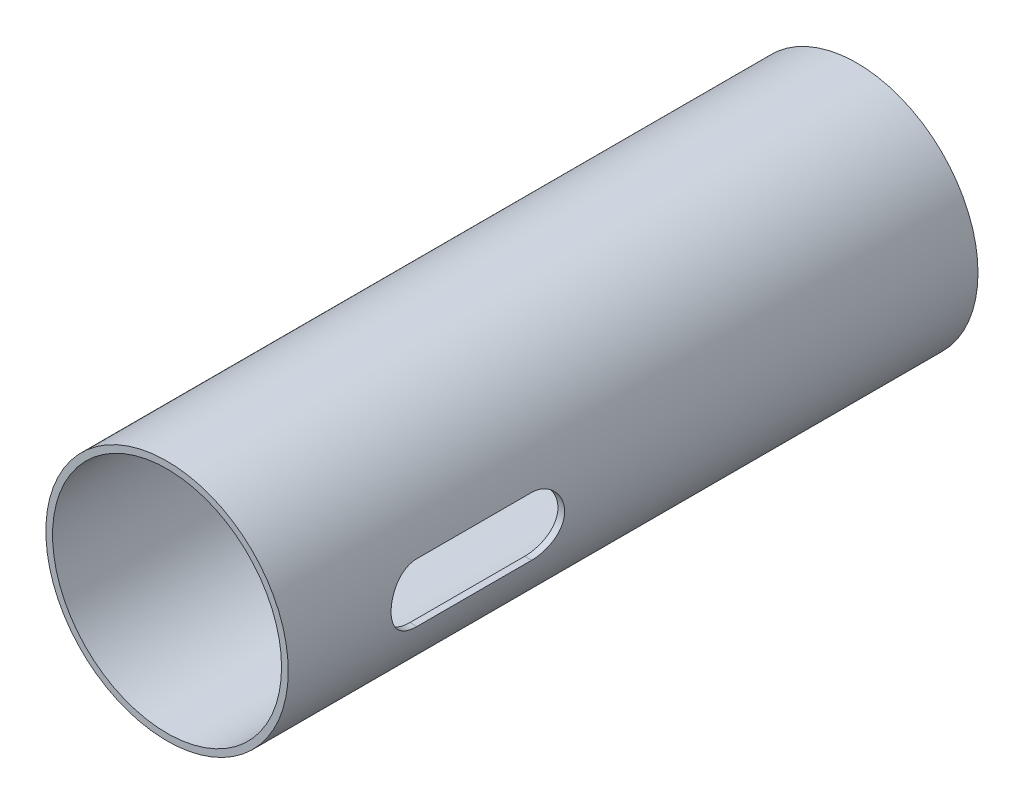
ISO-10303-21;
HEADER;
FILE_DESCRIPTION(('STEP AP214'),'2;1');
FILE_NAME('part.step','',(''),(''),'','','');
FILE_SCHEMA(('AUTOMOTIVE_DESIGN { 1 0 10303 214 1 1 1 1 }'));
ENDSEC;
DATA;
#1=APPLICATION_CONTEXT('core data for automotive mechanical design processes');
#2=APPLICATION_PROTOCOL_DEFINITION('international standard','automotive_design',2000,#1);
#3=PRODUCT_CONTEXT('',#1,'mechanical');
#4=PRODUCT('Part','Part','',(#3));
#5=PRODUCT_RELATED_PRODUCT_CATEGORY('part','',(#4));
#6=PRODUCT_DEFINITION_FORMATION('','',#4);
#7=PRODUCT_DEFINITION_CONTEXT('part definition',#1,'design');
#8=PRODUCT_DEFINITION('design','',#6,#7);
#9=PRODUCT_DEFINITION_SHAPE('','',#8);
#10=(LENGTH_UNIT() NAMED_UNIT(*) SI_UNIT(.MILLI.,.METRE.));
#11=(NAMED_UNIT(*) PLANE_ANGLE_UNIT() SI_UNIT($,.RADIAN.));
#12=(NAMED_UNIT(*) SI_UNIT($,.STERADIAN.) SOLID_ANGLE_UNIT());
#13=UNCERTAINTY_MEASURE_WITH_UNIT(LENGTH_MEASURE(1.E-05),#10,'distance_accuracy_value','');
#14=(GEOMETRIC_REPRESENTATION_CONTEXT(3) GLOBAL_UNCERTAINTY_ASSIGNED_CONTEXT((#13)) GLOBAL_UNIT_ASSIGNED_CONTEXT((#10,
#11,#12)) REPRESENTATION_CONTEXT('',''));
#15=CARTESIAN_POINT('',(0.,0.,0.));
#16=DIRECTION('',(0.,0.,1.));
#17=DIRECTION('',(1.,0.,0.));
#18=AXIS2_PLACEMENT_3D('',#15,#16,#17);
#19=CARTESIAN_POINT('',(-89.6750213814962,9.53355709039162,71.882));
#20=DIRECTION('',(0.,0.,-1.));
#21=DIRECTION('',(-1.,0.,0.));
#22=AXIS2_PLACEMENT_3D('',#19,#20,#21);
#23=CYLINDRICAL_SURFACE('',#22,12.630912);
#24=CARTESIAN_POINT('',(-89.6750213814962,9.53355709039162,0.));
#25=DIRECTION('',(0.,0.,1.));
#26=DIRECTION('',(1.,0.,0.));
#27=AXIS2_PLACEMENT_3D('',#24,#25,#26);
#28=CIRCLE('',#27,12.630912);
#29=CARTESIAN_POINT('',(-77.0441093814962,9.53355709039162,0.));
#30=VERTEX_POINT('',#29);
#31=EDGE_CURVE('E164',#30,#30,#28,.T.);
#32=ORIENTED_EDGE('',*,*,#31,.T.);
#33=EDGE_LOOP('',(#32));
#34=FACE_BOUND('',#33,.T.);
#35=CARTESIAN_POINT('',(-89.6750213814962,9.53355709039162,71.882));
#36=DIRECTION('',(0.,0.,1.));
#37=DIRECTION('',(1.,0.,0.));
#38=AXIS2_PLACEMENT_3D('',#35,#36,#37);
#39=CIRCLE('',#38,12.630912);
#40=CARTESIAN_POINT('',(-77.0441093814962,9.53355709039162,71.882));
#41=VERTEX_POINT('',#40);
#42=EDGE_CURVE('E167',#41,#41,#39,.T.);
#43=ORIENTED_EDGE('',*,*,#42,.F.);
#44=EDGE_LOOP('',(#43));
#45=FACE_BOUND('',#44,.T.);
#46=CARTESIAN_POINT('',(-77.4205506274512,12.5942570903916,58.1025));
#47=CARTESIAN_POINT('',(-77.4205597551722,12.5942668022662,58.1872319621296));
#48=CARTESIAN_POINT('',(-77.4196720286538,12.5907386708303,58.2719582289308));
#49=CARTESIAN_POINT('',(-77.4161705456482,12.5766821357091,58.4407789440411));
#50=CARTESIAN_POINT('',(-77.4135570664939,12.5661548568039,58.5248734916734));
#51=CARTESIAN_POINT('',(-77.4066782544381,12.5382019648172,58.691679412553));
#52=CARTESIAN_POINT('',(-77.4024160680688,12.520789490627,58.7743931093385));
#53=CARTESIAN_POINT('',(-77.3923741798188,12.479226655496,58.9379927834944));
#54=CARTESIAN_POINT('',(-77.3865944595793,12.4550762130413,59.0188787387404));
#55=CARTESIAN_POINT('',(-77.3672198042348,12.3727786836014,59.257940088386));
#56=CARTESIAN_POINT('',(-77.3515822224708,12.3047580788924,59.412680522662));
#57=CARTESIAN_POINT('',(-77.3166370458355,12.1444877207903,59.7085151537322));
#58=CARTESIAN_POINT('',(-77.2973285678804,12.052232135301,59.8496060545977));
#59=CARTESIAN_POINT('',(-77.2567726141075,11.8440678696077,60.1171104595098));
#60=CARTESIAN_POINT('',(-77.2354958869418,11.7277533763998,60.2432043348171));
#61=CARTESIAN_POINT('',(-77.1936537642062,11.4756439557968,60.4743004746053));
#62=CARTESIAN_POINT('',(-77.1730884820644,11.3398459396824,60.579299388559));
#63=CARTESIAN_POINT('',(-77.1346633564195,11.0504323594004,60.766529623486));
#64=CARTESIAN_POINT('',(-77.1168423106015,10.896607449675,60.8484460292532));
#65=CARTESIAN_POINT('',(-77.0862495832728,10.5768761578171,60.9851349772085));
#66=CARTESIAN_POINT('',(-77.0734769499666,10.4109720600089,61.0399126364564));
#67=CARTESIAN_POINT('',(-77.0546269352904,10.0751424417077,61.119748320122));
#68=CARTESIAN_POINT('',(-77.0484265190277,9.90535394557074,61.1453531834799));
#69=CARTESIAN_POINT('',(-77.0429913733059,9.56378194408475,61.1678312036752));
#70=CARTESIAN_POINT('',(-77.0437558295126,9.39199867431064,61.164707719436));
#71=CARTESIAN_POINT('',(-77.0520723494062,9.05510806545909,61.1302135543752));
#72=CARTESIAN_POINT('',(-77.0594824694649,8.88993621771923,61.0994335586551));
#73=CARTESIAN_POINT('',(-77.0800932654017,8.56717670995179,61.0114477409843));
#74=CARTESIAN_POINT('',(-77.0932941882632,8.40958937372928,60.9542407918926));
#75=CARTESIAN_POINT('',(-77.1242235392697,8.104891012333,60.8145349781668));
#76=CARTESIAN_POINT('',(-77.1419900634578,7.95788215532242,60.7318220662535));
#77=CARTESIAN_POINT('',(-77.180117277992,7.67962558142181,60.5436155481387));
#78=CARTESIAN_POINT('',(-77.2004783305762,7.54838007032977,60.4381187595075));
#79=CARTESIAN_POINT('',(-77.2421804328081,7.30186499629148,60.2041744292038));
#80=CARTESIAN_POINT('',(-77.2635332408029,7.18708481162836,60.0752128442448));
#81=CARTESIAN_POINT('',(-77.3043422772229,6.98064793131839,59.7996099694934));
#82=CARTESIAN_POINT('',(-77.3237979866191,6.88899755294656,59.6529638657846));
#83=CARTESIAN_POINT('',(-77.358653446909,6.73112753125918,59.3452150730659));
#84=CARTESIAN_POINT('',(-77.374033046964,6.66503351798501,59.1840456521858));
#85=CARTESIAN_POINT('',(-77.398726679257,6.56111240532616,58.8525187137842));
#86=CARTESIAN_POINT('',(-77.4080497624317,6.5232431140188,58.6821753204562));
#87=CARTESIAN_POINT('',(-77.4160260149772,6.49102064733336,58.4423957796957));
#88=CARTESIAN_POINT('',(-77.417720260866,6.48420791459521,58.3745495386021));
#89=CARTESIAN_POINT('',(-77.4199819864485,6.47513136408779,58.2386461919585));
#90=CARTESIAN_POINT('',(-77.4205513040308,6.47286012642885,58.1705896126));
#91=CARTESIAN_POINT('',(-77.4205506274512,6.47285709039162,58.1025));
#92=B_SPLINE_CURVE_WITH_KNOTS('',3,(#46,#47,#48,#49,#50,#51,#52,#53,#54,#55,#56,#57,#58,#59,#60,
#61,#62,#63,#64,#65,#66,#67,#68,#69,#70,#71,#72,#73,#74,#75,#76,#77,#78,#79,#80,#81,#82,#83,#84,
#85,#86,#87,#88,#89,#90,#91),.UNSPECIFIED.,.F.,.F.,(4,2,2,2,2,2,2,2,2,2,2,2,2,2,2,2,2,2,2,2,2,2,
4),(0.,0.254107971341708,0.508175116779808,0.761759752418379,1.01534745598173,1.52203703579352,
2.02884866124606,2.54503142473061,3.06129610917466,3.58429635856214,4.10719795773912,
4.62012770578534,5.13299748275965,5.63516717992807,6.13735829721223,6.64388412232631,
7.15048074428322,7.66992063555304,8.18950224448186,8.71160649179252,9.23292869388703,
9.43742597871754,9.64158888222228),.UNSPECIFIED.);
#93=CARTESIAN_POINT('',(-77.4205506274512,12.5942570903916,58.1025));
#94=VERTEX_POINT('',#93);
#95=CARTESIAN_POINT('',(-77.4205506274512,6.47285709039162,58.1025));
#96=VERTEX_POINT('',#95);
#97=EDGE_CURVE('E93',#94,#96,#92,.T.);
#98=ORIENTED_EDGE('',*,*,#97,.F.);
#99=DIRECTION('',(0.,0.,-1.));
#100=VECTOR('',#99,1.);
#101=CARTESIAN_POINT('',(-77.4205506274512,12.5942570903916,71.882));
#102=LINE('',#101,#100);
#103=CARTESIAN_POINT('',(-77.4205506274512,12.5942570903916,46.1391));
#104=VERTEX_POINT('',#103);
#105=EDGE_CURVE('E82',#104,#94,#102,.F.);
#106=ORIENTED_EDGE('',*,*,#105,.F.);
#107=CARTESIAN_POINT('',(-77.4205506274512,6.47285709039162,46.1391));
#108=CARTESIAN_POINT('',(-77.4205597551722,6.47284737851707,46.0543680378704));
#109=CARTESIAN_POINT('',(-77.4196720286538,6.47637550995293,45.9696417710692));
#110=CARTESIAN_POINT('',(-77.4161705456482,6.49043204507412,45.8008210559589));
#111=CARTESIAN_POINT('',(-77.4135570664939,6.50095932397939,45.7167265083266));
#112=CARTESIAN_POINT('',(-77.4066782544381,6.52891221596601,45.549920587447));
#113=CARTESIAN_POINT('',(-77.4024160680688,6.54632469015623,45.4672068906615));
#114=CARTESIAN_POINT('',(-77.3923741798188,6.58788752528725,45.3036072165056));
#115=CARTESIAN_POINT('',(-77.3865944595793,6.61203796774199,45.2227212612596));
#116=CARTESIAN_POINT('',(-77.3672198042348,6.69433549718182,44.983659911614));
#117=CARTESIAN_POINT('',(-77.3515822224708,6.76235610189085,44.828919477338));
#118=CARTESIAN_POINT('',(-77.3166370458355,6.92262645999294,44.5330848462678));
#119=CARTESIAN_POINT('',(-77.2973285678804,7.0148820454822,44.3919939454023));
#120=CARTESIAN_POINT('',(-77.2567726141075,7.2230463111755,44.1244895404902));
#121=CARTESIAN_POINT('',(-77.2354958869418,7.33936080438342,43.9983956651829));
#122=CARTESIAN_POINT('',(-77.1936537642062,7.59147022498649,43.7672995253947));
#123=CARTESIAN_POINT('',(-77.1730884820644,7.72726824110086,43.662300611441));
#124=CARTESIAN_POINT('',(-77.1346633564195,8.01668182138283,43.475070376514));
#125=CARTESIAN_POINT('',(-77.1168423106015,8.17050673110827,43.3931539707468));
#126=CARTESIAN_POINT('',(-77.0862495832728,8.49023802296614,43.2564650227915));
#127=CARTESIAN_POINT('',(-77.0734769499666,8.65614212077436,43.2016873635437));
#128=CARTESIAN_POINT('',(-77.0546269352904,8.9919717390755,43.121851679878));
#129=CARTESIAN_POINT('',(-77.0484265190277,9.16176023521251,43.0962468165201));
#130=CARTESIAN_POINT('',(-77.0429913733059,9.50333223669849,43.0737687963248));
#131=CARTESIAN_POINT('',(-77.0437558295126,9.6751155064726,43.076892280564));
#132=CARTESIAN_POINT('',(-77.0520723494062,10.0120061153242,43.1113864456248));
#133=CARTESIAN_POINT('',(-77.0594824694649,10.177177963064,43.142166441345));
#134=CARTESIAN_POINT('',(-77.0800932654017,10.4999374708315,43.2301522590157));
#135=CARTESIAN_POINT('',(-77.0932941882632,10.657524807054,43.2873592081074));
#136=CARTESIAN_POINT('',(-77.1242235392697,10.9622231684503,43.4270650218332));
#137=CARTESIAN_POINT('',(-77.1419900634578,11.1092320254608,43.5097779337465));
#138=CARTESIAN_POINT('',(-77.180117277992,11.3874885993614,43.6979844518614));
#139=CARTESIAN_POINT('',(-77.2004783305762,11.5187341104535,43.8034812404925));
#140=CARTESIAN_POINT('',(-77.2421804328081,11.7652491844918,44.0374255707962));
#141=CARTESIAN_POINT('',(-77.2635332408029,11.8800293691549,44.1663871557552));
#142=CARTESIAN_POINT('',(-77.3043422772229,12.0864662494649,44.4419900305066));
#143=CARTESIAN_POINT('',(-77.3237979866191,12.1781166278367,44.5886361342154));
#144=CARTESIAN_POINT('',(-77.358653446909,12.3359866495241,44.8963849269341));
#145=CARTESIAN_POINT('',(-77.374033046964,12.4020806627982,45.0575543478142));
#146=CARTESIAN_POINT('',(-77.398726679257,12.5060017754571,45.3890812862158));
#147=CARTESIAN_POINT('',(-77.4080497624317,12.5438710667644,45.5594246795438));
#148=CARTESIAN_POINT('',(-77.4160260149772,12.5760935334499,45.7992042203043));
#149=CARTESIAN_POINT('',(-77.417720260866,12.582906266188,45.8670504613979));
#150=CARTESIAN_POINT('',(-77.4199819864485,12.5919828166955,46.0029538080415));
#151=CARTESIAN_POINT('',(-77.4205513040308,12.5942540543544,46.0710103874));
#152=CARTESIAN_POINT('',(-77.4205506274512,12.5942570903916,46.1391));
#153=B_SPLINE_CURVE_WITH_KNOTS('',3,(#107,#108,#109,#110,#111,#112,#113,#114,#115,#116,#117,
#118,#119,#120,#121,#122,#123,#124,#125,#126,#127,#128,#129,#130,#131,#132,#133,#134,#135,#136,
#137,#138,#139,#140,#141,#142,#143,#144,#145,#146,#147,#148,#149,#150,#151,#152),.UNSPECIFIED.,
.F.,.F.,(4,2,2,2,2,2,2,2,2,2,2,2,2,2,2,2,2,2,2,2,2,2,4),(0.,0.254107971341708,0.508175116779808,
0.761759752418379,1.01534745598173,1.52203703579352,2.02884866124606,2.5450314247306,
3.06129610917466,3.58429635856214,4.10719795773912,4.62012770578534,5.13299748275965,
5.63516717992807,6.13735829721223,6.64388412232631,7.15048074428322,7.66992063555304,
8.18950224448187,8.71160649179252,9.23292869388703,9.43742597871754,9.64158888222229),.UNSPECIFIED.);
#154=CARTESIAN_POINT('',(-77.4205506274512,6.47285709039162,46.1391));
#155=VERTEX_POINT('',#154);
#156=EDGE_CURVE('E87',#155,#104,#153,.T.);
#157=ORIENTED_EDGE('',*,*,#156,.F.);
#158=DIRECTION('',(0.,0.,-1.));
#159=VECTOR('',#158,1.);
#160=CARTESIAN_POINT('',(-77.4205506274512,6.47285709039162,71.882));
#161=LINE('',#160,#159);
#162=EDGE_CURVE('E98',#96,#155,#161,.T.);
#163=ORIENTED_EDGE('',*,*,#162,.F.);
#164=EDGE_LOOP('',(#98,#106,#157,#163));
#165=FACE_BOUND('',#164,.T.);
#166=ADVANCED_FACE('F38',(#34,#45,#165),#23,.T.);
#167=CARTESIAN_POINT('',(-89.6750213814962,9.53355709039162,71.882));
#168=DIRECTION('',(0.,0.,-1.));
#169=DIRECTION('',(-1.,0.,0.));
#170=AXIS2_PLACEMENT_3D('',#167,#168,#169);
#171=CYLINDRICAL_SURFACE('',#170,11.932412);
#172=CARTESIAN_POINT('',(-89.6750213814962,9.53355709039162,71.882));
#173=DIRECTION('',(0.,0.,1.));
#174=DIRECTION('',(1.,0.,0.));
#175=AXIS2_PLACEMENT_3D('',#172,#173,#174);
#176=CIRCLE('',#175,11.932412);
#177=CARTESIAN_POINT('',(-77.7426093814962,9.53355709039162,71.882));
#178=VERTEX_POINT('',#177);
#179=EDGE_CURVE('E102',#178,#178,#176,.T.);
#180=ORIENTED_EDGE('',*,*,#179,.T.);
#181=EDGE_LOOP('',(#180));
#182=FACE_BOUND('',#181,.T.);
#183=CARTESIAN_POINT('',(-89.6750213814962,9.53355709039162,0.));
#184=DIRECTION('',(0.,0.,1.));
#185=DIRECTION('',(1.,0.,0.));
#186=AXIS2_PLACEMENT_3D('',#183,#184,#185);
#187=CIRCLE('',#186,11.932412);
#188=CARTESIAN_POINT('',(-77.7426093814962,9.53355709039162,0.));
#189=VERTEX_POINT('',#188);
#190=EDGE_CURVE('E99',#189,#189,#187,.T.);
#191=ORIENTED_EDGE('',*,*,#190,.F.);
#192=EDGE_LOOP('',(#191));
#193=FACE_BOUND('',#192,.T.);
#194=DIRECTION('',(0.,0.,-1.));
#195=VECTOR('',#194,1.);
#196=CARTESIAN_POINT('',(-78.1418270430771,12.5942570903916,71.882));
#197=LINE('',#196,#195);
#198=CARTESIAN_POINT('',(-78.1418270430771,12.5942570903916,46.1391));
#199=VERTEX_POINT('',#198);
#200=CARTESIAN_POINT('',(-78.1418270430771,12.5942570903916,58.1025));
#201=VERTEX_POINT('',#200);
#202=EDGE_CURVE('E133',#199,#201,#197,.F.);
#203=ORIENTED_EDGE('',*,*,#202,.T.);
#204=CARTESIAN_POINT('',(-78.1418270430771,12.5942570903916,58.1025));
#205=CARTESIAN_POINT('',(-78.1418367817108,12.594266977754,58.1870673229297));
#206=CARTESIAN_POINT('',(-78.1408971250691,12.590752344436,58.2716287236894));
#207=CARTESIAN_POINT('',(-78.1371912669507,12.5767508458593,58.4401176608663));
#208=CARTESIAN_POINT('',(-78.134425384973,12.5662652001806,58.5240453055621));
#209=CARTESIAN_POINT('',(-78.1271467142683,12.5384268894498,58.6905045842826));
#210=CARTESIAN_POINT('',(-78.1226375043602,12.5210882909757,58.7730387190639));
#211=CARTESIAN_POINT('',(-78.1120150915519,12.4797061962228,58.9362803898901));
#212=CARTESIAN_POINT('',(-78.1059018642671,12.4556625980128,59.016987898146));
#213=CARTESIAN_POINT('',(-78.0854131599915,12.3737418555699,59.2555085326638));
#214=CARTESIAN_POINT('',(-78.06888056022,12.3060456466314,59.4098922516243));
#215=CARTESIAN_POINT('',(-78.031942054283,12.1465663767833,59.7050821433837));
#216=CARTESIAN_POINT('',(-78.0115350176408,12.0547762828021,59.8458843352595));
#217=CARTESIAN_POINT('',(-77.9686207892242,11.847439951552,60.1132250546856));
#218=CARTESIAN_POINT('',(-77.9460788158428,11.7314404565338,60.2394071491847));
#219=CARTESIAN_POINT('',(-77.90173442864,11.4799507667995,60.4707571939333));
#220=CARTESIAN_POINT('',(-77.8799321341785,11.3444574447322,60.5759217659087));
#221=CARTESIAN_POINT('',(-77.8391364766739,11.0553566519875,60.7637306335581));
#222=CARTESIAN_POINT('',(-77.8201892282581,10.9015117232519,60.8460203241561));
#223=CARTESIAN_POINT('',(-77.7876396509947,10.5816124898648,60.9834292923546));
#224=CARTESIAN_POINT('',(-77.7740362316344,10.4155606844845,61.0385541140623));
#225=CARTESIAN_POINT('',(-77.7539530745171,10.0797016357899,61.1189197112033));
#226=CARTESIAN_POINT('',(-77.747328017802,9.91004931629522,61.1447709817315));
#227=CARTESIAN_POINT('',(-77.7414409279877,9.56869136571714,61.1677736628805));
#228=CARTESIAN_POINT('',(-77.742177913191,9.39698601144716,61.1649288999969));
#229=CARTESIAN_POINT('',(-77.7508246332742,9.06064368893253,61.1310547754959));
#230=CARTESIAN_POINT('',(-77.7585664408865,8.89593529700606,61.100685239294));
#231=CARTESIAN_POINT('',(-77.7801562762957,8.57403698924418,61.0136866164323));
#232=CARTESIAN_POINT('',(-77.7940045820968,8.41684741607141,60.9570563342207));
#233=CARTESIAN_POINT('',(-77.8265054876964,8.11272756268841,60.8186200425561));
#234=CARTESIAN_POINT('',(-77.8452020484999,7.9659076797117,60.7365822562954));
#235=CARTESIAN_POINT('',(-77.8853759523796,7.68789301978718,60.5498377265063));
#236=CARTESIAN_POINT('',(-77.9068537402651,7.5567007486636,60.4451273550849));
#237=CARTESIAN_POINT('',(-77.9509738977402,7.30973888292319,60.2125003716814));
#238=CARTESIAN_POINT('',(-77.9736320207141,7.1945121029184,60.0840099154517));
#239=CARTESIAN_POINT('',(-78.0170101924244,6.98708976814818,59.8092562665634));
#240=CARTESIAN_POINT('',(-78.0377297080134,6.89490053749049,59.6629882100647));
#241=CARTESIAN_POINT('',(-78.074948217926,6.73579013873709,59.3556995161276));
#242=CARTESIAN_POINT('',(-78.0914217474657,6.66902033137214,59.1945973899248));
#243=CARTESIAN_POINT('',(-78.117953625081,6.563769799604,58.8630226732961));
#244=CARTESIAN_POINT('',(-78.1280215762318,6.52524671517068,58.6925645279328));
#245=CARTESIAN_POINT('',(-78.136774921354,6.49194707433089,58.4509292630541));
#246=CARTESIAN_POINT('',(-78.1386664030284,6.48478731184249,58.3813925090008));
#247=CARTESIAN_POINT('',(-78.1411919840229,6.47524758173455,58.2420816102892));
#248=CARTESIAN_POINT('',(-78.1418281014861,6.47285994229713,58.1723080275821));
#249=CARTESIAN_POINT('',(-78.1418270430771,6.47285709039162,58.1025));
#250=B_SPLINE_CURVE_WITH_KNOTS('',3,(#204,#205,#206,#207,#208,#209,#210,#211,#212,#213,#214,
#215,#216,#217,#218,#219,#220,#221,#222,#223,#224,#225,#226,#227,#228,#229,#230,#231,#232,#233,
#234,#235,#236,#237,#238,#239,#240,#241,#242,#243,#244,#245,#246,#247,#248,#249),.UNSPECIFIED.,
.F.,.F.,(4,2,2,2,2,2,2,2,2,2,2,2,2,2,2,2,2,2,2,2,2,2,4),(0.,0.253613548063676,0.507182738057978,
0.760234125023801,1.01328935915748,1.51888110079226,2.0246205904939,2.54085009647484,
3.05716251254614,3.58108149115703,4.10489349825059,4.61756781641244,5.13017377250819,
5.63080741066535,6.13146384300289,6.63682912079886,7.14227532310141,7.66205401054526,
8.18197522766072,8.70494563271207,9.22713015526768,9.43677942409103,9.64609138206307),.UNSPECIFIED.);
#251=CARTESIAN_POINT('',(-78.1418270430771,6.47285709039162,58.1025));
#252=VERTEX_POINT('',#251);
#253=EDGE_CURVE('E11',#201,#252,#250,.T.);
#254=ORIENTED_EDGE('',*,*,#253,.T.);
#255=DIRECTION('',(0.,0.,-1.));
#256=VECTOR('',#255,1.);
#257=CARTESIAN_POINT('',(-78.1418270430771,6.47285709039162,71.882));
#258=LINE('',#257,#256);
#259=CARTESIAN_POINT('',(-78.1418270430771,6.47285709039162,46.1391));
#260=VERTEX_POINT('',#259);
#261=EDGE_CURVE('E52',#252,#260,#258,.T.);
#262=ORIENTED_EDGE('',*,*,#261,.T.);
#263=CARTESIAN_POINT('',(-78.1418270430771,6.47285709039162,46.1391));
#264=CARTESIAN_POINT('',(-78.1418367817108,6.47284720302925,46.0545326770703));
#265=CARTESIAN_POINT('',(-78.1408971250691,6.47636183634722,45.9699712763106));
#266=CARTESIAN_POINT('',(-78.1371912669507,6.49036333492392,45.8014823391337));
#267=CARTESIAN_POINT('',(-78.134425384973,6.50084898060264,45.7175546944379));
#268=CARTESIAN_POINT('',(-78.1271467142683,6.52868729133345,45.5510954157174));
#269=CARTESIAN_POINT('',(-78.1226375043602,6.54602588980757,45.4685612809362));
#270=CARTESIAN_POINT('',(-78.1120150915519,6.58740798456045,45.3053196101099));
#271=CARTESIAN_POINT('',(-78.1059018642671,6.61145158277049,45.224612101854));
#272=CARTESIAN_POINT('',(-78.0854131599915,6.69337232521335,44.9860914673362));
#273=CARTESIAN_POINT('',(-78.06888056022,6.76106853415186,44.8317077483757));
#274=CARTESIAN_POINT('',(-78.031942054283,6.92054780399993,44.5365178566163));
#275=CARTESIAN_POINT('',(-78.0115350176408,7.01233789798115,44.3957156647405));
#276=CARTESIAN_POINT('',(-77.9686207892242,7.2196742292312,44.1283749453144));
#277=CARTESIAN_POINT('',(-77.9460788158428,7.33567372424947,44.0021928508153));
#278=CARTESIAN_POINT('',(-77.90173442864,7.58716341398375,43.7708428060667));
#279=CARTESIAN_POINT('',(-77.8799321341785,7.72265673605109,43.6656782340914));
#280=CARTESIAN_POINT('',(-77.8391364766739,8.0117575287957,43.4778693664419));
#281=CARTESIAN_POINT('',(-77.8201892282581,8.16560245753133,43.3955796758439));
#282=CARTESIAN_POINT('',(-77.7876396509947,8.48550169091844,43.2581707076454));
#283=CARTESIAN_POINT('',(-77.7740362316344,8.65155349629876,43.2030458859377));
#284=CARTESIAN_POINT('',(-77.7539530745171,8.98741254499332,43.1226802887967));
#285=CARTESIAN_POINT('',(-77.747328017802,9.15706486448803,43.0968290182685));
#286=CARTESIAN_POINT('',(-77.7414409279877,9.4984228150661,43.0738263371195));
#287=CARTESIAN_POINT('',(-77.742177913191,9.67012816933608,43.0766711000031));
#288=CARTESIAN_POINT('',(-77.7508246332742,10.0064704918507,43.1105452245041));
#289=CARTESIAN_POINT('',(-77.7585664408865,10.1711788837772,43.140914760706));
#290=CARTESIAN_POINT('',(-77.7801562762957,10.4930771915391,43.2279133835677));
#291=CARTESIAN_POINT('',(-77.7940045820968,10.6502667647118,43.2845436657793));
#292=CARTESIAN_POINT('',(-77.8265054876964,10.9543866180948,43.4229799574439));
#293=CARTESIAN_POINT('',(-77.8452020484999,11.1012065010715,43.5050177437046));
#294=CARTESIAN_POINT('',(-77.8853759523796,11.3792211609961,43.6917622734937));
#295=CARTESIAN_POINT('',(-77.9068537402651,11.5104134321196,43.7964726449151));
#296=CARTESIAN_POINT('',(-77.9509738977402,11.7573752978601,44.0290996283186));
#297=CARTESIAN_POINT('',(-77.9736320207141,11.8726020778648,44.1575900845483));
#298=CARTESIAN_POINT('',(-78.0170101924244,12.0800244126351,44.4323437334366));
#299=CARTESIAN_POINT('',(-78.0377297080134,12.1722136432928,44.5786117899353));
#300=CARTESIAN_POINT('',(-78.074948217926,12.3313240420462,44.8859004838724));
#301=CARTESIAN_POINT('',(-78.0914217474657,12.3980938494111,45.0470026100752));
#302=CARTESIAN_POINT('',(-78.117953625081,12.5033443811792,45.378577326704));
#303=CARTESIAN_POINT('',(-78.1280215762318,12.5418674656126,45.5490354720672));
#304=CARTESIAN_POINT('',(-78.136774921354,12.5751671064524,45.7906707369459));
#305=CARTESIAN_POINT('',(-78.1386664030284,12.5823268689408,45.8602074909992));
#306=CARTESIAN_POINT('',(-78.1411919840229,12.5918665990487,45.9995183897108));
#307=CARTESIAN_POINT('',(-78.1418281014861,12.5942542384861,46.0692919724179));
#308=CARTESIAN_POINT('',(-78.1418270430771,12.5942570903916,46.1391));
#309=B_SPLINE_CURVE_WITH_KNOTS('',3,(#263,#264,#265,#266,#267,#268,#269,#270,#271,#272,#273,
#274,#275,#276,#277,#278,#279,#280,#281,#282,#283,#284,#285,#286,#287,#288,#289,#290,#291,#292,
#293,#294,#295,#296,#297,#298,#299,#300,#301,#302,#303,#304,#305,#306,#307,#308),.UNSPECIFIED.,
.F.,.F.,(4,2,2,2,2,2,2,2,2,2,2,2,2,2,2,2,2,2,2,2,2,2,4),(0.,0.253613548063676,0.507182738057978,
0.760234125023801,1.01328935915748,1.51888110079225,2.0246205904939,2.54085009647485,
3.05716251254614,3.58108149115703,4.10489349825059,4.61756781641244,5.13017377250819,
5.63080741066535,6.13146384300289,6.63682912079886,7.14227532310141,7.66205401054526,
8.18197522766072,8.70494563271207,9.22713015526768,9.43677942409105,9.64609138206308),.UNSPECIFIED.);
#310=EDGE_CURVE('E126',#260,#199,#309,.T.);
#311=ORIENTED_EDGE('',*,*,#310,.T.);
#312=EDGE_LOOP('',(#203,#254,#262,#311));
#313=FACE_BOUND('',#312,.T.);
#314=ADVANCED_FACE('F117',(#182,#193,#313),#171,.F.);
#315=CARTESIAN_POINT('',(-89.6750213814962,9.53355709039162,71.882));
#316=DIRECTION('',(0.,0.,1.));
#317=DIRECTION('',(1.,0.,0.));
#318=AXIS2_PLACEMENT_3D('',#315,#316,#317);
#319=PLANE('',#318);
#320=ORIENTED_EDGE('',*,*,#179,.F.);
#321=EDGE_LOOP('',(#320));
#322=FACE_BOUND('',#321,.T.);
#323=ORIENTED_EDGE('',*,*,#42,.T.);
#324=EDGE_LOOP('',(#323));
#325=FACE_BOUND('',#324,.T.);
#326=ADVANCED_FACE('F122',(#322,#325),#319,.T.);
#327=CARTESIAN_POINT('',(-89.6750213814962,9.53355709039162,0.));
#328=DIRECTION('',(0.,0.,1.));
#329=DIRECTION('',(1.,0.,0.));
#330=AXIS2_PLACEMENT_3D('',#327,#328,#329);
#331=PLANE('',#330);
#332=ORIENTED_EDGE('',*,*,#190,.T.);
#333=EDGE_LOOP('',(#332));
#334=FACE_BOUND('',#333,.T.);
#335=ORIENTED_EDGE('',*,*,#31,.F.);
#336=EDGE_LOOP('',(#335));
#337=FACE_BOUND('',#336,.T.);
#338=ADVANCED_FACE('F115',(#334,#337),#331,.F.);
#339=CARTESIAN_POINT('',(-17.78,9.53355709039162,58.1025));
#340=DIRECTION('',(-1.,0.,0.));
#341=DIRECTION('',(0.,0.,1.));
#342=AXIS2_PLACEMENT_3D('',#339,#340,#341);
#343=CYLINDRICAL_SURFACE('',#342,3.0607);
#344=ORIENTED_EDGE('',*,*,#97,.T.);
#345=DIRECTION('',(-1.,0.,0.));
#346=VECTOR('',#345,1.);
#347=CARTESIAN_POINT('',(-17.78,6.47285709039162,58.1025));
#348=LINE('',#347,#346);
#349=EDGE_CURVE('E88',#96,#252,#348,.T.);
#350=ORIENTED_EDGE('',*,*,#349,.T.);
#351=ORIENTED_EDGE('',*,*,#253,.F.);
#352=DIRECTION('',(-1.,0.,0.));
#353=VECTOR('',#352,1.);
#354=CARTESIAN_POINT('',(-17.78,12.5942570903916,58.1025));
#355=LINE('',#354,#353);
#356=EDGE_CURVE('E64',#94,#201,#355,.T.);
#357=ORIENTED_EDGE('',*,*,#356,.F.);
#358=EDGE_LOOP('',(#344,#350,#351,#357));
#359=FACE_BOUND('',#358,.T.);
#360=ADVANCED_FACE('F91',(#359),#343,.F.);
#361=CARTESIAN_POINT('',(-17.78,6.47285709039162,58.1025));
#362=DIRECTION('',(0.,1.,0.));
#363=DIRECTION('',(0.,0.,1.));
#364=AXIS2_PLACEMENT_3D('',#361,#362,#363);
#365=PLANE('',#364);
#366=ORIENTED_EDGE('',*,*,#162,.T.);
#367=DIRECTION('',(-1.,0.,0.));
#368=VECTOR('',#367,1.);
#369=CARTESIAN_POINT('',(-17.78,6.47285709039162,46.1391));
#370=LINE('',#369,#368);
#371=EDGE_CURVE('E147',#155,#260,#370,.T.);
#372=ORIENTED_EDGE('',*,*,#371,.T.);
#373=ORIENTED_EDGE('',*,*,#261,.F.);
#374=ORIENTED_EDGE('',*,*,#349,.F.);
#375=EDGE_LOOP('',(#366,#372,#373,#374));
#376=FACE_BOUND('',#375,.T.);
#377=ADVANCED_FACE('F114',(#376),#365,.T.);
#378=CARTESIAN_POINT('',(-17.78,9.53355709039162,46.1391));
#379=DIRECTION('',(-1.,0.,0.));
#380=DIRECTION('',(0.,0.,1.));
#381=AXIS2_PLACEMENT_3D('',#378,#379,#380);
#382=CYLINDRICAL_SURFACE('',#381,3.0607);
#383=ORIENTED_EDGE('',*,*,#156,.T.);
#384=DIRECTION('',(-1.,0.,0.));
#385=VECTOR('',#384,1.);
#386=CARTESIAN_POINT('',(-17.78,12.5942570903916,46.1391));
#387=LINE('',#386,#385);
#388=EDGE_CURVE('E59',#104,#199,#387,.T.);
#389=ORIENTED_EDGE('',*,*,#388,.T.);
#390=ORIENTED_EDGE('',*,*,#310,.F.);
#391=ORIENTED_EDGE('',*,*,#371,.F.);
#392=EDGE_LOOP('',(#383,#389,#390,#391));
#393=FACE_BOUND('',#392,.T.);
#394=ADVANCED_FACE('F135',(#393),#382,.F.);
#395=CARTESIAN_POINT('',(-17.78,12.5942570903916,58.1025));
#396=DIRECTION('',(0.,-1.,0.));
#397=DIRECTION('',(0.,0.,-1.));
#398=AXIS2_PLACEMENT_3D('',#395,#396,#397);
#399=PLANE('',#398);
#400=ORIENTED_EDGE('',*,*,#105,.T.);
#401=ORIENTED_EDGE('',*,*,#356,.T.);
#402=ORIENTED_EDGE('',*,*,#202,.F.);
#403=ORIENTED_EDGE('',*,*,#388,.F.);
#404=EDGE_LOOP('',(#400,#401,#402,#403));
#405=FACE_BOUND('',#404,.T.);
#406=ADVANCED_FACE('F83',(#405),#399,.T.);
#407=CLOSED_SHELL('',(#166,#314,#326,#338,#360,#377,#394,#406));
#408=MANIFOLD_SOLID_BREP('B2',#407);
#409=ADVANCED_BREP_SHAPE_REPRESENTATION('',(#18,#408),#14);
#410=SHAPE_DEFINITION_REPRESENTATION(#9,#409);
ENDSEC;
END-ISO-10303-21;
